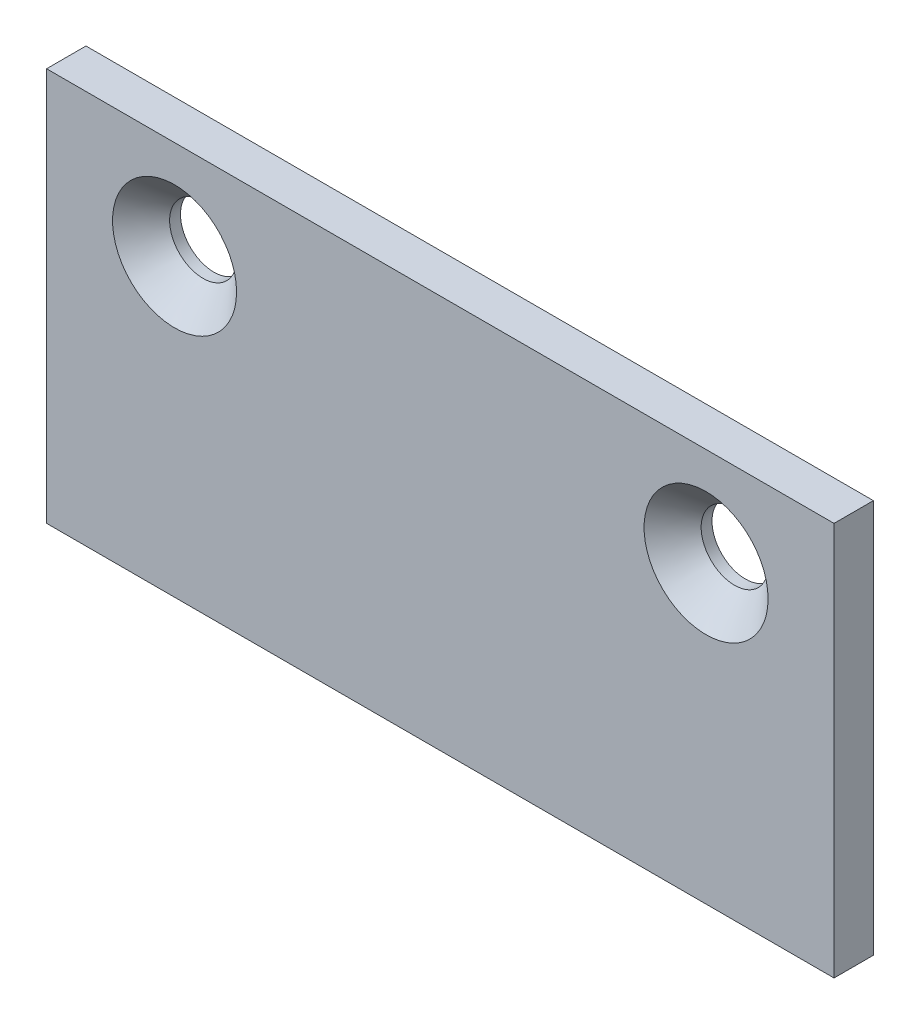
ISO-10303-21;
HEADER;
FILE_DESCRIPTION(('STEP AP214'),'2;1');
FILE_NAME('part.step','',(''),(''),'','','');
FILE_SCHEMA(('AUTOMOTIVE_DESIGN { 1 0 10303 214 1 1 1 1 }'));
ENDSEC;
DATA;
#1=APPLICATION_CONTEXT('core data for automotive mechanical design processes');
#2=APPLICATION_PROTOCOL_DEFINITION('international standard','automotive_design',2000,#1);
#3=PRODUCT_CONTEXT('',#1,'mechanical');
#4=PRODUCT('Part','Part','',(#3));
#5=PRODUCT_RELATED_PRODUCT_CATEGORY('part','',(#4));
#6=PRODUCT_DEFINITION_FORMATION('','',#4);
#7=PRODUCT_DEFINITION_CONTEXT('part definition',#1,'design');
#8=PRODUCT_DEFINITION('design','',#6,#7);
#9=PRODUCT_DEFINITION_SHAPE('','',#8);
#10=(LENGTH_UNIT() NAMED_UNIT(*) SI_UNIT(.MILLI.,.METRE.));
#11=(NAMED_UNIT(*) PLANE_ANGLE_UNIT() SI_UNIT($,.RADIAN.));
#12=(NAMED_UNIT(*) SI_UNIT($,.STERADIAN.) SOLID_ANGLE_UNIT());
#13=UNCERTAINTY_MEASURE_WITH_UNIT(LENGTH_MEASURE(1.E-05),#10,'distance_accuracy_value','');
#14=(GEOMETRIC_REPRESENTATION_CONTEXT(3) GLOBAL_UNCERTAINTY_ASSIGNED_CONTEXT((#13)) GLOBAL_UNIT_ASSIGNED_CONTEXT((#10,
#11,#12)) REPRESENTATION_CONTEXT('',''));
#15=CARTESIAN_POINT('',(0.,0.,0.));
#16=DIRECTION('',(0.,0.,1.));
#17=DIRECTION('',(1.,0.,0.));
#18=AXIS2_PLACEMENT_3D('',#15,#16,#17);
#19=CARTESIAN_POINT('',(-20.,10.,2.));
#20=DIRECTION('',(1.,0.,0.));
#21=DIRECTION('',(0.,0.,-1.));
#22=AXIS2_PLACEMENT_3D('',#19,#20,#21);
#23=PLANE('',#22);
#24=DIRECTION('',(0.,-1.,0.));
#25=VECTOR('',#24,1.);
#26=CARTESIAN_POINT('',(-20.,10.,0.));
#27=LINE('',#26,#25);
#28=CARTESIAN_POINT('',(-20.,10.,0.));
#29=VERTEX_POINT('',#28);
#30=CARTESIAN_POINT('',(-20.,-10.,0.));
#31=VERTEX_POINT('',#30);
#32=EDGE_CURVE('E95',#29,#31,#27,.T.);
#33=ORIENTED_EDGE('',*,*,#32,.T.);
#34=DIRECTION('',(0.,0.,-1.));
#35=VECTOR('',#34,1.);
#36=CARTESIAN_POINT('',(-20.,-10.,2.));
#37=LINE('',#36,#35);
#38=CARTESIAN_POINT('',(-20.,-10.,2.));
#39=VERTEX_POINT('',#38);
#40=EDGE_CURVE('E11',#39,#31,#37,.T.);
#41=ORIENTED_EDGE('',*,*,#40,.F.);
#42=DIRECTION('',(0.,-1.,0.));
#43=VECTOR('',#42,1.);
#44=CARTESIAN_POINT('',(-20.,10.,2.));
#45=LINE('',#44,#43);
#46=CARTESIAN_POINT('',(-20.,10.,2.));
#47=VERTEX_POINT('',#46);
#48=EDGE_CURVE('E83',#47,#39,#45,.T.);
#49=ORIENTED_EDGE('',*,*,#48,.F.);
#50=DIRECTION('',(0.,0.,-1.));
#51=VECTOR('',#50,1.);
#52=CARTESIAN_POINT('',(-20.,10.,2.));
#53=LINE('',#52,#51);
#54=EDGE_CURVE('E91',#47,#29,#53,.T.);
#55=ORIENTED_EDGE('',*,*,#54,.T.);
#56=EDGE_LOOP('',(#33,#41,#49,#55));
#57=FACE_BOUND('',#56,.T.);
#58=ADVANCED_FACE('F32',(#57),#23,.F.);
#59=CARTESIAN_POINT('',(-20.,-10.,2.));
#60=DIRECTION('',(0.,1.,0.));
#61=DIRECTION('',(-1.,0.,0.));
#62=AXIS2_PLACEMENT_3D('',#59,#60,#61);
#63=PLANE('',#62);
#64=DIRECTION('',(1.,0.,0.));
#65=VECTOR('',#64,1.);
#66=CARTESIAN_POINT('',(-20.,-10.,0.));
#67=LINE('',#66,#65);
#68=CARTESIAN_POINT('',(20.,-10.,0.));
#69=VERTEX_POINT('',#68);
#70=EDGE_CURVE('E87',#31,#69,#67,.T.);
#71=ORIENTED_EDGE('',*,*,#70,.T.);
#72=DIRECTION('',(0.,0.,-1.));
#73=VECTOR('',#72,1.);
#74=CARTESIAN_POINT('',(20.,-10.,2.));
#75=LINE('',#74,#73);
#76=CARTESIAN_POINT('',(20.,-10.,2.));
#77=VERTEX_POINT('',#76);
#78=EDGE_CURVE('E40',#77,#69,#75,.T.);
#79=ORIENTED_EDGE('',*,*,#78,.F.);
#80=DIRECTION('',(1.,0.,0.));
#81=VECTOR('',#80,1.);
#82=CARTESIAN_POINT('',(-20.,-10.,2.));
#83=LINE('',#82,#81);
#84=EDGE_CURVE('E78',#39,#77,#83,.T.);
#85=ORIENTED_EDGE('',*,*,#84,.F.);
#86=ORIENTED_EDGE('',*,*,#40,.T.);
#87=EDGE_LOOP('',(#71,#79,#85,#86));
#88=FACE_BOUND('',#87,.T.);
#89=ADVANCED_FACE('F86',(#88),#63,.F.);
#90=CARTESIAN_POINT('',(20.,10.,2.));
#91=DIRECTION('',(-1.,0.,0.));
#92=DIRECTION('',(0.,0.,1.));
#93=AXIS2_PLACEMENT_3D('',#90,#91,#92);
#94=PLANE('',#93);
#95=DIRECTION('',(0.,1.,0.));
#96=VECTOR('',#95,1.);
#97=CARTESIAN_POINT('',(20.,10.,0.));
#98=LINE('',#97,#96);
#99=CARTESIAN_POINT('',(20.,10.,0.));
#100=VERTEX_POINT('',#99);
#101=EDGE_CURVE('E65',#69,#100,#98,.T.);
#102=ORIENTED_EDGE('',*,*,#101,.T.);
#103=DIRECTION('',(0.,0.,-1.));
#104=VECTOR('',#103,1.);
#105=CARTESIAN_POINT('',(20.,10.,2.));
#106=LINE('',#105,#104);
#107=CARTESIAN_POINT('',(20.,10.,2.));
#108=VERTEX_POINT('',#107);
#109=EDGE_CURVE('E88',#108,#100,#106,.T.);
#110=ORIENTED_EDGE('',*,*,#109,.F.);
#111=DIRECTION('',(0.,1.,0.));
#112=VECTOR('',#111,1.);
#113=CARTESIAN_POINT('',(20.,10.,2.));
#114=LINE('',#113,#112);
#115=EDGE_CURVE('E81',#77,#108,#114,.T.);
#116=ORIENTED_EDGE('',*,*,#115,.F.);
#117=ORIENTED_EDGE('',*,*,#78,.T.);
#118=EDGE_LOOP('',(#102,#110,#116,#117));
#119=FACE_BOUND('',#118,.T.);
#120=ADVANCED_FACE('F89',(#119),#94,.F.);
#121=CARTESIAN_POINT('',(-20.,10.,2.));
#122=DIRECTION('',(0.,-1.,0.));
#123=DIRECTION('',(1.,0.,0.));
#124=AXIS2_PLACEMENT_3D('',#121,#122,#123);
#125=PLANE('',#124);
#126=DIRECTION('',(-1.,0.,0.));
#127=VECTOR('',#126,1.);
#128=CARTESIAN_POINT('',(-20.,10.,0.));
#129=LINE('',#128,#127);
#130=EDGE_CURVE('E71',#100,#29,#129,.T.);
#131=ORIENTED_EDGE('',*,*,#130,.T.);
#132=ORIENTED_EDGE('',*,*,#54,.F.);
#133=DIRECTION('',(-1.,0.,0.));
#134=VECTOR('',#133,1.);
#135=CARTESIAN_POINT('',(-20.,10.,2.));
#136=LINE('',#135,#134);
#137=EDGE_CURVE('E48',#108,#47,#136,.T.);
#138=ORIENTED_EDGE('',*,*,#137,.F.);
#139=ORIENTED_EDGE('',*,*,#109,.T.);
#140=EDGE_LOOP('',(#131,#132,#138,#139));
#141=FACE_BOUND('',#140,.T.);
#142=ADVANCED_FACE('F103',(#141),#125,.F.);
#143=CARTESIAN_POINT('',(0.,0.,2.));
#144=DIRECTION('',(0.,0.,1.));
#145=DIRECTION('',(1.,0.,0.));
#146=AXIS2_PLACEMENT_3D('',#143,#144,#145);
#147=PLANE('',#146);
#148=CARTESIAN_POINT('',(-13.5,5.,2.));
#149=DIRECTION('',(0.,0.,1.));
#150=DIRECTION('',(1.,0.,0.));
#151=AXIS2_PLACEMENT_3D('',#148,#149,#150);
#152=CIRCLE('',#151,3.15);
#153=CARTESIAN_POINT('',(-10.35,5.,2.));
#154=VERTEX_POINT('',#153);
#155=EDGE_CURVE('E123',#154,#154,#152,.T.);
#156=ORIENTED_EDGE('',*,*,#155,.F.);
#157=EDGE_LOOP('',(#156));
#158=FACE_BOUND('',#157,.T.);
#159=CARTESIAN_POINT('',(13.5,5.,2.));
#160=DIRECTION('',(0.,0.,1.));
#161=DIRECTION('',(1.,0.,0.));
#162=AXIS2_PLACEMENT_3D('',#159,#160,#161);
#163=CIRCLE('',#162,3.15);
#164=CARTESIAN_POINT('',(16.65,5.,2.));
#165=VERTEX_POINT('',#164);
#166=EDGE_CURVE('E114',#165,#165,#163,.T.);
#167=ORIENTED_EDGE('',*,*,#166,.F.);
#168=EDGE_LOOP('',(#167));
#169=FACE_BOUND('',#168,.T.);
#170=ORIENTED_EDGE('',*,*,#48,.T.);
#171=ORIENTED_EDGE('',*,*,#84,.T.);
#172=ORIENTED_EDGE('',*,*,#115,.T.);
#173=ORIENTED_EDGE('',*,*,#137,.T.);
#174=EDGE_LOOP('',(#170,#171,#172,#173));
#175=FACE_BOUND('',#174,.T.);
#176=ADVANCED_FACE('F79',(#158,#169,#175),#147,.T.);
#177=CARTESIAN_POINT('',(0.,0.,0.));
#178=DIRECTION('',(0.,0.,1.));
#179=DIRECTION('',(1.,0.,0.));
#180=AXIS2_PLACEMENT_3D('',#177,#178,#179);
#181=PLANE('',#180);
#182=CARTESIAN_POINT('',(-13.5,5.,0.));
#183=DIRECTION('',(0.,0.,1.));
#184=DIRECTION('',(1.,0.,0.));
#185=AXIS2_PLACEMENT_3D('',#182,#183,#184);
#186=CIRCLE('',#185,1.7);
#187=CARTESIAN_POINT('',(-11.8,5.,0.));
#188=VERTEX_POINT('',#187);
#189=EDGE_CURVE('E117',#188,#188,#186,.T.);
#190=ORIENTED_EDGE('',*,*,#189,.T.);
#191=EDGE_LOOP('',(#190));
#192=FACE_BOUND('',#191,.T.);
#193=CARTESIAN_POINT('',(13.5,5.,0.));
#194=DIRECTION('',(0.,0.,1.));
#195=DIRECTION('',(1.,0.,0.));
#196=AXIS2_PLACEMENT_3D('',#193,#194,#195);
#197=CIRCLE('',#196,1.7);
#198=CARTESIAN_POINT('',(15.2,5.,0.));
#199=VERTEX_POINT('',#198);
#200=EDGE_CURVE('E98',#199,#199,#197,.T.);
#201=ORIENTED_EDGE('',*,*,#200,.T.);
#202=EDGE_LOOP('',(#201));
#203=FACE_BOUND('',#202,.T.);
#204=ORIENTED_EDGE('',*,*,#32,.F.);
#205=ORIENTED_EDGE('',*,*,#130,.F.);
#206=ORIENTED_EDGE('',*,*,#101,.F.);
#207=ORIENTED_EDGE('',*,*,#70,.F.);
#208=EDGE_LOOP('',(#204,#205,#206,#207));
#209=FACE_BOUND('',#208,.T.);
#210=ADVANCED_FACE('F106',(#192,#203,#209),#181,.F.);
#211=CARTESIAN_POINT('',(13.5,5.,2.));
#212=DIRECTION('',(0.,0.,1.));
#213=DIRECTION('',(1.,0.,0.));
#214=AXIS2_PLACEMENT_3D('',#211,#212,#213);
#215=CYLINDRICAL_SURFACE('',#214,1.7);
#216=ORIENTED_EDGE('',*,*,#200,.F.);
#217=EDGE_LOOP('',(#216));
#218=FACE_BOUND('',#217,.T.);
#219=CARTESIAN_POINT('',(13.5,5.,0.549999999999998));
#220=DIRECTION('',(0.,0.,1.));
#221=DIRECTION('',(1.,0.,0.));
#222=AXIS2_PLACEMENT_3D('',#219,#220,#221);
#223=CIRCLE('',#222,1.7);
#224=CARTESIAN_POINT('',(15.2,5.,0.549999999999998));
#225=VERTEX_POINT('',#224);
#226=EDGE_CURVE('E111',#225,#225,#223,.T.);
#227=ORIENTED_EDGE('',*,*,#226,.T.);
#228=EDGE_LOOP('',(#227));
#229=FACE_BOUND('',#228,.T.);
#230=ADVANCED_FACE('F137',(#218,#229),#215,.F.);
#231=CARTESIAN_POINT('',(13.5,5.,2.));
#232=DIRECTION('',(0.,0.,1.));
#233=DIRECTION('',(1.,0.,0.));
#234=AXIS2_PLACEMENT_3D('',#231,#232,#233);
#235=CONICAL_SURFACE('',#234,3.15,0.785398163397448);
#236=ORIENTED_EDGE('',*,*,#226,.F.);
#237=EDGE_LOOP('',(#236));
#238=FACE_BOUND('',#237,.T.);
#239=ORIENTED_EDGE('',*,*,#166,.T.);
#240=EDGE_LOOP('',(#239));
#241=FACE_BOUND('',#240,.T.);
#242=ADVANCED_FACE('F134',(#238,#241),#235,.F.);
#243=CARTESIAN_POINT('',(-13.5,5.,2.));
#244=DIRECTION('',(0.,0.,1.));
#245=DIRECTION('',(1.,0.,0.));
#246=AXIS2_PLACEMENT_3D('',#243,#244,#245);
#247=CYLINDRICAL_SURFACE('',#246,1.7);
#248=ORIENTED_EDGE('',*,*,#189,.F.);
#249=EDGE_LOOP('',(#248));
#250=FACE_BOUND('',#249,.T.);
#251=CARTESIAN_POINT('',(-13.5,5.,0.549999999999998));
#252=DIRECTION('',(0.,0.,1.));
#253=DIRECTION('',(1.,0.,0.));
#254=AXIS2_PLACEMENT_3D('',#251,#252,#253);
#255=CIRCLE('',#254,1.7);
#256=CARTESIAN_POINT('',(-11.8,5.,0.549999999999998));
#257=VERTEX_POINT('',#256);
#258=EDGE_CURVE('E120',#257,#257,#255,.T.);
#259=ORIENTED_EDGE('',*,*,#258,.T.);
#260=EDGE_LOOP('',(#259));
#261=FACE_BOUND('',#260,.T.);
#262=ADVANCED_FACE('F136',(#250,#261),#247,.F.);
#263=CARTESIAN_POINT('',(-13.5,5.,2.));
#264=DIRECTION('',(0.,0.,1.));
#265=DIRECTION('',(1.,0.,0.));
#266=AXIS2_PLACEMENT_3D('',#263,#264,#265);
#267=CONICAL_SURFACE('',#266,3.15,0.785398163397448);
#268=ORIENTED_EDGE('',*,*,#258,.F.);
#269=EDGE_LOOP('',(#268));
#270=FACE_BOUND('',#269,.T.);
#271=ORIENTED_EDGE('',*,*,#155,.T.);
#272=EDGE_LOOP('',(#271));
#273=FACE_BOUND('',#272,.T.);
#274=ADVANCED_FACE('F127',(#270,#273),#267,.F.);
#275=CLOSED_SHELL('',(#58,#89,#120,#142,#176,#210,#230,#242,#262,#274));
#276=MANIFOLD_SOLID_BREP('B2',#275);
#277=ADVANCED_BREP_SHAPE_REPRESENTATION('',(#18,#276),#14);
#278=SHAPE_DEFINITION_REPRESENTATION(#9,#277);
ENDSEC;
END-ISO-10303-21;
